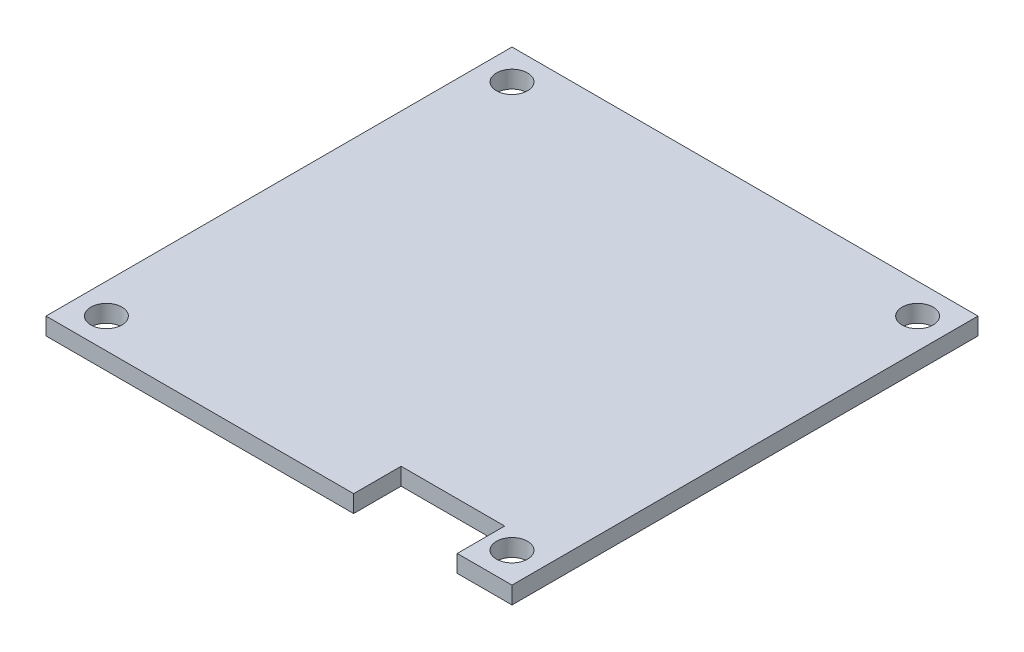
ISO-10303-21;
HEADER;
FILE_DESCRIPTION(('STEP AP214'),'2;1');
FILE_NAME('part.step','',(''),(''),'','','');
FILE_SCHEMA(('AUTOMOTIVE_DESIGN { 1 0 10303 214 1 1 1 1 }'));
ENDSEC;
DATA;
#1=APPLICATION_CONTEXT('core data for automotive mechanical design processes');
#2=APPLICATION_PROTOCOL_DEFINITION('international standard','automotive_design',2000,#1);
#3=PRODUCT_CONTEXT('',#1,'mechanical');
#4=PRODUCT('Part','Part','',(#3));
#5=PRODUCT_RELATED_PRODUCT_CATEGORY('part','',(#4));
#6=PRODUCT_DEFINITION_FORMATION('','',#4);
#7=PRODUCT_DEFINITION_CONTEXT('part definition',#1,'design');
#8=PRODUCT_DEFINITION('design','',#6,#7);
#9=PRODUCT_DEFINITION_SHAPE('','',#8);
#10=(LENGTH_UNIT() NAMED_UNIT(*) SI_UNIT(.MILLI.,.METRE.));
#11=(NAMED_UNIT(*) PLANE_ANGLE_UNIT() SI_UNIT($,.RADIAN.));
#12=(NAMED_UNIT(*) SI_UNIT($,.STERADIAN.) SOLID_ANGLE_UNIT());
#13=UNCERTAINTY_MEASURE_WITH_UNIT(LENGTH_MEASURE(1.E-05),#10,'distance_accuracy_value','');
#14=(GEOMETRIC_REPRESENTATION_CONTEXT(3) GLOBAL_UNCERTAINTY_ASSIGNED_CONTEXT((#13)) GLOBAL_UNIT_ASSIGNED_CONTEXT((#10,
#11,#12)) REPRESENTATION_CONTEXT('',''));
#15=CARTESIAN_POINT('',(0.,0.,0.));
#16=DIRECTION('',(0.,0.,1.));
#17=DIRECTION('',(1.,0.,0.));
#18=AXIS2_PLACEMENT_3D('',#15,#16,#17);
#19=CARTESIAN_POINT('',(8.65,2.,0.));
#20=DIRECTION('',(1.,0.,0.));
#21=DIRECTION('',(0.,0.,-1.));
#22=AXIS2_PLACEMENT_3D('',#19,#20,#21);
#23=PLANE('',#22);
#24=DIRECTION('',(0.,0.,1.));
#25=VECTOR('',#24,1.);
#26=CARTESIAN_POINT('',(8.65,0.,0.));
#27=LINE('',#26,#25);
#28=CARTESIAN_POINT('',(8.65,0.,21.5));
#29=VERTEX_POINT('',#28);
#30=CARTESIAN_POINT('',(8.65,0.,27.));
#31=VERTEX_POINT('',#30);
#32=EDGE_CURVE('E142',#29,#31,#27,.T.);
#33=ORIENTED_EDGE('',*,*,#32,.F.);
#34=DIRECTION('',(0.,-1.,0.));
#35=VECTOR('',#34,1.);
#36=CARTESIAN_POINT('',(8.65,2.,21.5));
#37=LINE('',#36,#35);
#38=CARTESIAN_POINT('',(8.65,2.,21.5));
#39=VERTEX_POINT('',#38);
#40=EDGE_CURVE('E11',#39,#29,#37,.T.);
#41=ORIENTED_EDGE('',*,*,#40,.F.);
#42=DIRECTION('',(0.,0.,1.));
#43=VECTOR('',#42,1.);
#44=CARTESIAN_POINT('',(8.65,2.,0.));
#45=LINE('',#44,#43);
#46=CARTESIAN_POINT('',(8.65,2.,27.));
#47=VERTEX_POINT('',#46);
#48=EDGE_CURVE('E168',#39,#47,#45,.T.);
#49=ORIENTED_EDGE('',*,*,#48,.T.);
#50=DIRECTION('',(0.,-1.,0.));
#51=VECTOR('',#50,1.);
#52=CARTESIAN_POINT('',(8.65,2.,27.));
#53=LINE('',#52,#51);
#54=EDGE_CURVE('E86',#47,#31,#53,.T.);
#55=ORIENTED_EDGE('',*,*,#54,.T.);
#56=EDGE_LOOP('',(#33,#41,#49,#55));
#57=FACE_BOUND('',#56,.T.);
#58=ADVANCED_FACE('F35',(#57),#23,.T.);
#59=CARTESIAN_POINT('',(0.,2.,21.5));
#60=DIRECTION('',(0.,0.,-1.));
#61=DIRECTION('',(-1.,0.,0.));
#62=AXIS2_PLACEMENT_3D('',#59,#60,#61);
#63=PLANE('',#62);
#64=DIRECTION('',(1.,0.,0.));
#65=VECTOR('',#64,1.);
#66=CARTESIAN_POINT('',(0.,0.,21.5));
#67=LINE('',#66,#65);
#68=CARTESIAN_POINT('',(20.65,0.,21.5));
#69=VERTEX_POINT('',#68);
#70=EDGE_CURVE('E145',#29,#69,#67,.T.);
#71=ORIENTED_EDGE('',*,*,#70,.T.);
#72=DIRECTION('',(0.,-1.,0.));
#73=VECTOR('',#72,1.);
#74=CARTESIAN_POINT('',(20.65,2.,21.5));
#75=LINE('',#74,#73);
#76=CARTESIAN_POINT('',(20.65,2.,21.5));
#77=VERTEX_POINT('',#76);
#78=EDGE_CURVE('E43',#77,#69,#75,.T.);
#79=ORIENTED_EDGE('',*,*,#78,.F.);
#80=DIRECTION('',(1.,0.,0.));
#81=VECTOR('',#80,1.);
#82=CARTESIAN_POINT('',(0.,2.,21.5));
#83=LINE('',#82,#81);
#84=EDGE_CURVE('E200',#39,#77,#83,.T.);
#85=ORIENTED_EDGE('',*,*,#84,.F.);
#86=ORIENTED_EDGE('',*,*,#40,.T.);
#87=EDGE_LOOP('',(#71,#79,#85,#86));
#88=FACE_BOUND('',#87,.T.);
#89=ADVANCED_FACE('F202',(#88),#63,.F.);
#90=CARTESIAN_POINT('',(20.65,2.,0.));
#91=DIRECTION('',(1.,0.,0.));
#92=DIRECTION('',(0.,0.,-1.));
#93=AXIS2_PLACEMENT_3D('',#90,#91,#92);
#94=PLANE('',#93);
#95=DIRECTION('',(0.,0.,1.));
#96=VECTOR('',#95,1.);
#97=CARTESIAN_POINT('',(20.65,0.,0.));
#98=LINE('',#97,#96);
#99=CARTESIAN_POINT('',(20.65,0.,27.));
#100=VERTEX_POINT('',#99);
#101=EDGE_CURVE('E147',#69,#100,#98,.T.);
#102=ORIENTED_EDGE('',*,*,#101,.T.);
#103=DIRECTION('',(0.,-1.,0.));
#104=VECTOR('',#103,1.);
#105=CARTESIAN_POINT('',(20.65,2.,27.));
#106=LINE('',#105,#104);
#107=CARTESIAN_POINT('',(20.65,2.,27.));
#108=VERTEX_POINT('',#107);
#109=EDGE_CURVE('E175',#108,#100,#106,.T.);
#110=ORIENTED_EDGE('',*,*,#109,.F.);
#111=DIRECTION('',(0.,0.,1.));
#112=VECTOR('',#111,1.);
#113=CARTESIAN_POINT('',(20.65,2.,0.));
#114=LINE('',#113,#112);
#115=EDGE_CURVE('E184',#77,#108,#114,.T.);
#116=ORIENTED_EDGE('',*,*,#115,.F.);
#117=ORIENTED_EDGE('',*,*,#78,.T.);
#118=EDGE_LOOP('',(#102,#110,#116,#117));
#119=FACE_BOUND('',#118,.T.);
#120=ADVANCED_FACE('F182',(#119),#94,.F.);
#121=CARTESIAN_POINT('',(0.,2.,27.));
#122=DIRECTION('',(0.,0.,-1.));
#123=DIRECTION('',(-1.,0.,0.));
#124=AXIS2_PLACEMENT_3D('',#121,#122,#123);
#125=PLANE('',#124);
#126=DIRECTION('',(1.,0.,0.));
#127=VECTOR('',#126,1.);
#128=CARTESIAN_POINT('',(0.,0.,27.));
#129=LINE('',#128,#127);
#130=CARTESIAN_POINT('',(27.,0.,27.));
#131=VERTEX_POINT('',#130);
#132=EDGE_CURVE('E149',#100,#131,#129,.T.);
#133=ORIENTED_EDGE('',*,*,#132,.T.);
#134=DIRECTION('',(0.,-1.,0.));
#135=VECTOR('',#134,1.);
#136=CARTESIAN_POINT('',(27.,2.,27.));
#137=LINE('',#136,#135);
#138=CARTESIAN_POINT('',(27.,2.,27.));
#139=VERTEX_POINT('',#138);
#140=EDGE_CURVE('E172',#139,#131,#137,.T.);
#141=ORIENTED_EDGE('',*,*,#140,.F.);
#142=DIRECTION('',(1.,0.,0.));
#143=VECTOR('',#142,1.);
#144=CARTESIAN_POINT('',(0.,2.,27.));
#145=LINE('',#144,#143);
#146=EDGE_CURVE('E128',#108,#139,#145,.T.);
#147=ORIENTED_EDGE('',*,*,#146,.F.);
#148=ORIENTED_EDGE('',*,*,#109,.T.);
#149=EDGE_LOOP('',(#133,#141,#147,#148));
#150=FACE_BOUND('',#149,.T.);
#151=ADVANCED_FACE('F194',(#150),#125,.F.);
#152=CARTESIAN_POINT('',(27.,2.,0.));
#153=DIRECTION('',(-1.,0.,0.));
#154=DIRECTION('',(0.,0.,1.));
#155=AXIS2_PLACEMENT_3D('',#152,#153,#154);
#156=PLANE('',#155);
#157=DIRECTION('',(0.,0.,-1.));
#158=VECTOR('',#157,1.);
#159=CARTESIAN_POINT('',(27.,0.,0.));
#160=LINE('',#159,#158);
#161=CARTESIAN_POINT('',(27.,0.,-27.));
#162=VERTEX_POINT('',#161);
#163=EDGE_CURVE('E151',#131,#162,#160,.T.);
#164=ORIENTED_EDGE('',*,*,#163,.T.);
#165=DIRECTION('',(0.,-1.,0.));
#166=VECTOR('',#165,1.);
#167=CARTESIAN_POINT('',(27.,2.,-27.));
#168=LINE('',#167,#166);
#169=CARTESIAN_POINT('',(27.,2.,-27.));
#170=VERTEX_POINT('',#169);
#171=EDGE_CURVE('E121',#170,#162,#168,.T.);
#172=ORIENTED_EDGE('',*,*,#171,.F.);
#173=DIRECTION('',(0.,0.,-1.));
#174=VECTOR('',#173,1.);
#175=CARTESIAN_POINT('',(27.,2.,0.));
#176=LINE('',#175,#174);
#177=EDGE_CURVE('E112',#139,#170,#176,.T.);
#178=ORIENTED_EDGE('',*,*,#177,.F.);
#179=ORIENTED_EDGE('',*,*,#140,.T.);
#180=EDGE_LOOP('',(#164,#172,#178,#179));
#181=FACE_BOUND('',#180,.T.);
#182=ADVANCED_FACE('F197',(#181),#156,.F.);
#183=CARTESIAN_POINT('',(0.,2.,-27.));
#184=DIRECTION('',(0.,0.,1.));
#185=DIRECTION('',(1.,0.,0.));
#186=AXIS2_PLACEMENT_3D('',#183,#184,#185);
#187=PLANE('',#186);
#188=DIRECTION('',(-1.,0.,0.));
#189=VECTOR('',#188,1.);
#190=CARTESIAN_POINT('',(0.,0.,-27.));
#191=LINE('',#190,#189);
#192=CARTESIAN_POINT('',(-27.,0.,-27.));
#193=VERTEX_POINT('',#192);
#194=EDGE_CURVE('E120',#162,#193,#191,.T.);
#195=ORIENTED_EDGE('',*,*,#194,.T.);
#196=DIRECTION('',(0.,-1.,0.));
#197=VECTOR('',#196,1.);
#198=CARTESIAN_POINT('',(-27.,2.,-27.));
#199=LINE('',#198,#197);
#200=CARTESIAN_POINT('',(-27.,2.,-27.));
#201=VERTEX_POINT('',#200);
#202=EDGE_CURVE('E117',#201,#193,#199,.T.);
#203=ORIENTED_EDGE('',*,*,#202,.F.);
#204=DIRECTION('',(-1.,0.,0.));
#205=VECTOR('',#204,1.);
#206=CARTESIAN_POINT('',(0.,2.,-27.));
#207=LINE('',#206,#205);
#208=EDGE_CURVE('E105',#170,#201,#207,.T.);
#209=ORIENTED_EDGE('',*,*,#208,.F.);
#210=ORIENTED_EDGE('',*,*,#171,.T.);
#211=EDGE_LOOP('',(#195,#203,#209,#210));
#212=FACE_BOUND('',#211,.T.);
#213=ADVANCED_FACE('F118',(#212),#187,.F.);
#214=CARTESIAN_POINT('',(-27.,2.,0.));
#215=DIRECTION('',(1.,0.,0.));
#216=DIRECTION('',(0.,0.,-1.));
#217=AXIS2_PLACEMENT_3D('',#214,#215,#216);
#218=PLANE('',#217);
#219=DIRECTION('',(0.,0.,1.));
#220=VECTOR('',#219,1.);
#221=CARTESIAN_POINT('',(-27.,0.,0.));
#222=LINE('',#221,#220);
#223=CARTESIAN_POINT('',(-27.,0.,27.));
#224=VERTEX_POINT('',#223);
#225=EDGE_CURVE('E79',#193,#224,#222,.T.);
#226=ORIENTED_EDGE('',*,*,#225,.T.);
#227=DIRECTION('',(0.,-1.,0.));
#228=VECTOR('',#227,1.);
#229=CARTESIAN_POINT('',(-27.,2.,27.));
#230=LINE('',#229,#228);
#231=CARTESIAN_POINT('',(-27.,2.,27.));
#232=VERTEX_POINT('',#231);
#233=EDGE_CURVE('E122',#232,#224,#230,.T.);
#234=ORIENTED_EDGE('',*,*,#233,.F.);
#235=DIRECTION('',(0.,0.,1.));
#236=VECTOR('',#235,1.);
#237=CARTESIAN_POINT('',(-27.,2.,0.));
#238=LINE('',#237,#236);
#239=EDGE_CURVE('E110',#201,#232,#238,.T.);
#240=ORIENTED_EDGE('',*,*,#239,.F.);
#241=ORIENTED_EDGE('',*,*,#202,.T.);
#242=EDGE_LOOP('',(#226,#234,#240,#241));
#243=FACE_BOUND('',#242,.T.);
#244=ADVANCED_FACE('F124',(#243),#218,.F.);
#245=CARTESIAN_POINT('',(23.5,2.,23.5));
#246=DIRECTION('',(0.,-1.,0.));
#247=DIRECTION('',(0.,0.,-1.));
#248=AXIS2_PLACEMENT_3D('',#245,#246,#247);
#249=CYLINDRICAL_SURFACE('',#248,1.8);
#250=CARTESIAN_POINT('',(23.5,2.,23.5));
#251=DIRECTION('',(0.,1.,0.));
#252=DIRECTION('',(0.,0.,1.));
#253=AXIS2_PLACEMENT_3D('',#250,#251,#252);
#254=CIRCLE('',#253,1.8);
#255=CARTESIAN_POINT('',(23.5,2.,25.3));
#256=VERTEX_POINT('',#255);
#257=EDGE_CURVE('E136',#256,#256,#254,.T.);
#258=ORIENTED_EDGE('',*,*,#257,.T.);
#259=EDGE_LOOP('',(#258));
#260=FACE_BOUND('',#259,.T.);
#261=CARTESIAN_POINT('',(23.5,0.,23.5));
#262=DIRECTION('',(0.,1.,0.));
#263=DIRECTION('',(0.,0.,1.));
#264=AXIS2_PLACEMENT_3D('',#261,#262,#263);
#265=CIRCLE('',#264,1.8);
#266=CARTESIAN_POINT('',(23.5,0.,25.3));
#267=VERTEX_POINT('',#266);
#268=EDGE_CURVE('E162',#267,#267,#265,.T.);
#269=ORIENTED_EDGE('',*,*,#268,.F.);
#270=EDGE_LOOP('',(#269));
#271=FACE_BOUND('',#270,.T.);
#272=ADVANCED_FACE('F216',(#260,#271),#249,.F.);
#273=CARTESIAN_POINT('',(-23.5,2.,-23.5));
#274=DIRECTION('',(0.,-1.,0.));
#275=DIRECTION('',(0.,0.,-1.));
#276=AXIS2_PLACEMENT_3D('',#273,#274,#275);
#277=CYLINDRICAL_SURFACE('',#276,1.8);
#278=CARTESIAN_POINT('',(-23.5,2.,-23.5));
#279=DIRECTION('',(0.,1.,0.));
#280=DIRECTION('',(0.,0.,1.));
#281=AXIS2_PLACEMENT_3D('',#278,#279,#280);
#282=CIRCLE('',#281,1.8);
#283=CARTESIAN_POINT('',(-23.5,2.,-21.7));
#284=VERTEX_POINT('',#283);
#285=EDGE_CURVE('E133',#284,#284,#282,.T.);
#286=ORIENTED_EDGE('',*,*,#285,.T.);
#287=EDGE_LOOP('',(#286));
#288=FACE_BOUND('',#287,.T.);
#289=CARTESIAN_POINT('',(-23.5,0.,-23.5));
#290=DIRECTION('',(0.,1.,0.));
#291=DIRECTION('',(0.,0.,1.));
#292=AXIS2_PLACEMENT_3D('',#289,#290,#291);
#293=CIRCLE('',#292,1.8);
#294=CARTESIAN_POINT('',(-23.5,0.,-21.7));
#295=VERTEX_POINT('',#294);
#296=EDGE_CURVE('E159',#295,#295,#293,.T.);
#297=ORIENTED_EDGE('',*,*,#296,.F.);
#298=EDGE_LOOP('',(#297));
#299=FACE_BOUND('',#298,.T.);
#300=ADVANCED_FACE('F225',(#288,#299),#277,.F.);
#301=CARTESIAN_POINT('',(23.5,2.,-23.5));
#302=DIRECTION('',(0.,-1.,0.));
#303=DIRECTION('',(0.,0.,-1.));
#304=AXIS2_PLACEMENT_3D('',#301,#302,#303);
#305=CYLINDRICAL_SURFACE('',#304,1.8);
#306=CARTESIAN_POINT('',(23.5,2.,-23.5));
#307=DIRECTION('',(0.,1.,0.));
#308=DIRECTION('',(0.,0.,1.));
#309=AXIS2_PLACEMENT_3D('',#306,#307,#308);
#310=CIRCLE('',#309,1.8);
#311=CARTESIAN_POINT('',(23.5,2.,-21.7));
#312=VERTEX_POINT('',#311);
#313=EDGE_CURVE('E126',#312,#312,#310,.T.);
#314=ORIENTED_EDGE('',*,*,#313,.T.);
#315=EDGE_LOOP('',(#314));
#316=FACE_BOUND('',#315,.T.);
#317=CARTESIAN_POINT('',(23.5,0.,-23.5));
#318=DIRECTION('',(0.,1.,0.));
#319=DIRECTION('',(0.,0.,1.));
#320=AXIS2_PLACEMENT_3D('',#317,#318,#319);
#321=CIRCLE('',#320,1.8);
#322=CARTESIAN_POINT('',(23.5,0.,-21.7));
#323=VERTEX_POINT('',#322);
#324=EDGE_CURVE('E156',#323,#323,#321,.T.);
#325=ORIENTED_EDGE('',*,*,#324,.F.);
#326=EDGE_LOOP('',(#325));
#327=FACE_BOUND('',#326,.T.);
#328=ADVANCED_FACE('F221',(#316,#327),#305,.F.);
#329=EDGE_CURVE('E152',#224,#31,#129,.T.);
#330=ORIENTED_EDGE('',*,*,#329,.T.);
#331=ORIENTED_EDGE('',*,*,#54,.F.);
#332=EDGE_CURVE('E51',#232,#47,#145,.T.);
#333=ORIENTED_EDGE('',*,*,#332,.F.);
#334=ORIENTED_EDGE('',*,*,#233,.T.);
#335=EDGE_LOOP('',(#330,#331,#333,#334));
#336=FACE_BOUND('',#335,.T.);
#337=ADVANCED_FACE('F217',(#336),#125,.F.);
#338=CARTESIAN_POINT('',(-23.5,2.,23.5));
#339=DIRECTION('',(0.,-1.,0.));
#340=DIRECTION('',(0.,0.,-1.));
#341=AXIS2_PLACEMENT_3D('',#338,#339,#340);
#342=CYLINDRICAL_SURFACE('',#341,1.8);
#343=CARTESIAN_POINT('',(-23.5,2.,23.5));
#344=DIRECTION('',(0.,1.,0.));
#345=DIRECTION('',(0.,0.,1.));
#346=AXIS2_PLACEMENT_3D('',#343,#344,#345);
#347=CIRCLE('',#346,1.8);
#348=CARTESIAN_POINT('',(-23.5,2.,25.3));
#349=VERTEX_POINT('',#348);
#350=EDGE_CURVE('E139',#349,#349,#347,.T.);
#351=ORIENTED_EDGE('',*,*,#350,.T.);
#352=EDGE_LOOP('',(#351));
#353=FACE_BOUND('',#352,.T.);
#354=CARTESIAN_POINT('',(-23.5,0.,23.5));
#355=DIRECTION('',(0.,1.,0.));
#356=DIRECTION('',(0.,0.,1.));
#357=AXIS2_PLACEMENT_3D('',#354,#355,#356);
#358=CIRCLE('',#357,1.8);
#359=CARTESIAN_POINT('',(-23.5,0.,25.3));
#360=VERTEX_POINT('',#359);
#361=EDGE_CURVE('E165',#360,#360,#358,.T.);
#362=ORIENTED_EDGE('',*,*,#361,.F.);
#363=EDGE_LOOP('',(#362));
#364=FACE_BOUND('',#363,.T.);
#365=ADVANCED_FACE('F220',(#353,#364),#342,.F.);
#366=CARTESIAN_POINT('',(0.,2.,0.));
#367=DIRECTION('',(0.,1.,0.));
#368=DIRECTION('',(0.,0.,1.));
#369=AXIS2_PLACEMENT_3D('',#366,#367,#368);
#370=PLANE('',#369);
#371=ORIENTED_EDGE('',*,*,#48,.F.);
#372=ORIENTED_EDGE('',*,*,#84,.T.);
#373=ORIENTED_EDGE('',*,*,#115,.T.);
#374=ORIENTED_EDGE('',*,*,#146,.T.);
#375=ORIENTED_EDGE('',*,*,#177,.T.);
#376=ORIENTED_EDGE('',*,*,#208,.T.);
#377=ORIENTED_EDGE('',*,*,#239,.T.);
#378=ORIENTED_EDGE('',*,*,#332,.T.);
#379=EDGE_LOOP('',(#371,#372,#373,#374,#375,#376,#377,#378));
#380=FACE_BOUND('',#379,.T.);
#381=ORIENTED_EDGE('',*,*,#313,.F.);
#382=EDGE_LOOP('',(#381));
#383=FACE_BOUND('',#382,.T.);
#384=ORIENTED_EDGE('',*,*,#285,.F.);
#385=EDGE_LOOP('',(#384));
#386=FACE_BOUND('',#385,.T.);
#387=ORIENTED_EDGE('',*,*,#257,.F.);
#388=EDGE_LOOP('',(#387));
#389=FACE_BOUND('',#388,.T.);
#390=ORIENTED_EDGE('',*,*,#350,.F.);
#391=EDGE_LOOP('',(#390));
#392=FACE_BOUND('',#391,.T.);
#393=ADVANCED_FACE('F107',(#380,#383,#386,#389,#392),#370,.T.);
#394=CARTESIAN_POINT('',(0.,0.,0.));
#395=DIRECTION('',(0.,1.,0.));
#396=DIRECTION('',(0.,0.,1.));
#397=AXIS2_PLACEMENT_3D('',#394,#395,#396);
#398=PLANE('',#397);
#399=ORIENTED_EDGE('',*,*,#32,.T.);
#400=ORIENTED_EDGE('',*,*,#329,.F.);
#401=ORIENTED_EDGE('',*,*,#225,.F.);
#402=ORIENTED_EDGE('',*,*,#194,.F.);
#403=ORIENTED_EDGE('',*,*,#163,.F.);
#404=ORIENTED_EDGE('',*,*,#132,.F.);
#405=ORIENTED_EDGE('',*,*,#101,.F.);
#406=ORIENTED_EDGE('',*,*,#70,.F.);
#407=EDGE_LOOP('',(#399,#400,#401,#402,#403,#404,#405,#406));
#408=FACE_BOUND('',#407,.T.);
#409=ORIENTED_EDGE('',*,*,#324,.T.);
#410=EDGE_LOOP('',(#409));
#411=FACE_BOUND('',#410,.T.);
#412=ORIENTED_EDGE('',*,*,#296,.T.);
#413=EDGE_LOOP('',(#412));
#414=FACE_BOUND('',#413,.T.);
#415=ORIENTED_EDGE('',*,*,#268,.T.);
#416=EDGE_LOOP('',(#415));
#417=FACE_BOUND('',#416,.T.);
#418=ORIENTED_EDGE('',*,*,#361,.T.);
#419=EDGE_LOOP('',(#418));
#420=FACE_BOUND('',#419,.T.);
#421=ADVANCED_FACE('F189',(#408,#411,#414,#417,#420),#398,.F.);
#422=CLOSED_SHELL('',(#58,#89,#120,#151,#182,#213,#244,#272,#300,#328,#337,#365,#393,#421));
#423=MANIFOLD_SOLID_BREP('B2',#422);
#424=ADVANCED_BREP_SHAPE_REPRESENTATION('',(#18,#423),#14);
#425=SHAPE_DEFINITION_REPRESENTATION(#9,#424);
ENDSEC;
END-ISO-10303-21;
